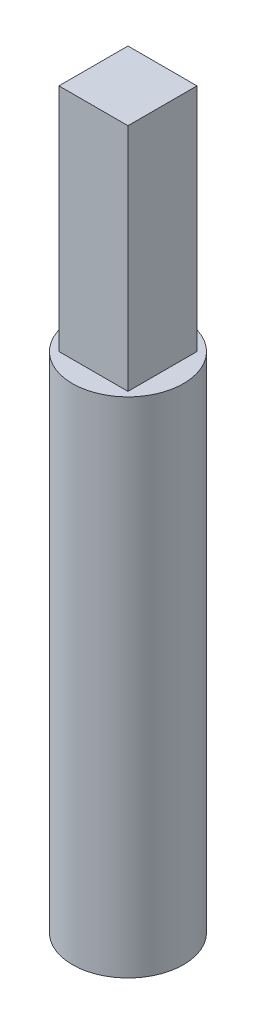
ISO-10303-21;
HEADER;
FILE_DESCRIPTION(('STEP AP214'),'2;1');
FILE_NAME('part.step','',(''),(''),'','','');
FILE_SCHEMA(('AUTOMOTIVE_DESIGN { 1 0 10303 214 1 1 1 1 }'));
ENDSEC;
DATA;
#1=APPLICATION_CONTEXT('core data for automotive mechanical design processes');
#2=APPLICATION_PROTOCOL_DEFINITION('international standard','automotive_design',2000,#1);
#3=PRODUCT_CONTEXT('',#1,'mechanical');
#4=PRODUCT('Part','Part','',(#3));
#5=PRODUCT_RELATED_PRODUCT_CATEGORY('part','',(#4));
#6=PRODUCT_DEFINITION_FORMATION('','',#4);
#7=PRODUCT_DEFINITION_CONTEXT('part definition',#1,'design');
#8=PRODUCT_DEFINITION('design','',#6,#7);
#9=PRODUCT_DEFINITION_SHAPE('','',#8);
#10=(LENGTH_UNIT() NAMED_UNIT(*) SI_UNIT(.MILLI.,.METRE.));
#11=(NAMED_UNIT(*) PLANE_ANGLE_UNIT() SI_UNIT($,.RADIAN.));
#12=(NAMED_UNIT(*) SI_UNIT($,.STERADIAN.) SOLID_ANGLE_UNIT());
#13=UNCERTAINTY_MEASURE_WITH_UNIT(LENGTH_MEASURE(1.E-05),#10,'distance_accuracy_value','');
#14=(GEOMETRIC_REPRESENTATION_CONTEXT(3) GLOBAL_UNCERTAINTY_ASSIGNED_CONTEXT((#13)) GLOBAL_UNIT_ASSIGNED_CONTEXT((#10,
#11,#12)) REPRESENTATION_CONTEXT('',''));
#15=CARTESIAN_POINT('',(0.,0.,0.));
#16=DIRECTION('',(0.,0.,1.));
#17=DIRECTION('',(1.,0.,0.));
#18=AXIS2_PLACEMENT_3D('',#15,#16,#17);
#19=CARTESIAN_POINT('',(0.,33.3375,0.));
#20=DIRECTION('',(0.,1.,0.));
#21=DIRECTION('',(0.,0.,1.));
#22=AXIS2_PLACEMENT_3D('',#19,#20,#21);
#23=PLANE('',#22);
#24=CARTESIAN_POINT('',(0.,33.3375,0.));
#25=DIRECTION('',(0.,1.,0.));
#26=DIRECTION('',(0.,0.,1.));
#27=AXIS2_PLACEMENT_3D('',#24,#25,#26);
#28=CIRCLE('',#27,3.68046);
#29=CARTESIAN_POINT('',(0.,33.3375,3.68046));
#30=VERTEX_POINT('',#29);
#31=EDGE_CURVE('E11',#30,#30,#28,.T.);
#32=ORIENTED_EDGE('',*,*,#31,.T.);
#33=EDGE_LOOP('',(#32));
#34=FACE_BOUND('',#33,.T.);
#35=DIRECTION('',(-1.,0.,0.));
#36=VECTOR('',#35,1.);
#37=CARTESIAN_POINT('',(-2.286,33.3375,-2.286));
#38=LINE('',#37,#36);
#39=CARTESIAN_POINT('',(2.286,33.3375,-2.286));
#40=VERTEX_POINT('',#39);
#41=CARTESIAN_POINT('',(-2.286,33.3375,-2.286));
#42=VERTEX_POINT('',#41);
#43=EDGE_CURVE('E89',#40,#42,#38,.T.);
#44=ORIENTED_EDGE('',*,*,#43,.F.);
#45=DIRECTION('',(0.,0.,-1.));
#46=VECTOR('',#45,1.);
#47=CARTESIAN_POINT('',(2.286,33.3375,-2.286));
#48=LINE('',#47,#46);
#49=CARTESIAN_POINT('',(2.286,33.3375,2.286));
#50=VERTEX_POINT('',#49);
#51=EDGE_CURVE('E100',#50,#40,#48,.T.);
#52=ORIENTED_EDGE('',*,*,#51,.F.);
#53=DIRECTION('',(1.,0.,0.));
#54=VECTOR('',#53,1.);
#55=CARTESIAN_POINT('',(-2.286,33.3375,2.286));
#56=LINE('',#55,#54);
#57=CARTESIAN_POINT('',(-2.286,33.3375,2.286));
#58=VERTEX_POINT('',#57);
#59=EDGE_CURVE('E70',#58,#50,#56,.T.);
#60=ORIENTED_EDGE('',*,*,#59,.F.);
#61=DIRECTION('',(0.,0.,1.));
#62=VECTOR('',#61,1.);
#63=CARTESIAN_POINT('',(-2.286,33.3375,-2.286));
#64=LINE('',#63,#62);
#65=EDGE_CURVE('E104',#42,#58,#64,.T.);
#66=ORIENTED_EDGE('',*,*,#65,.F.);
#67=EDGE_LOOP('',(#44,#52,#60,#66));
#68=FACE_BOUND('',#67,.T.);
#69=ADVANCED_FACE('F33',(#34,#68),#23,.T.);
#70=CARTESIAN_POINT('',(0.,33.3375,0.));
#71=DIRECTION('',(0.,-1.,0.));
#72=DIRECTION('',(0.,0.,-1.));
#73=AXIS2_PLACEMENT_3D('',#70,#71,#72);
#74=CYLINDRICAL_SURFACE('',#73,3.68046);
#75=ORIENTED_EDGE('',*,*,#31,.F.);
#76=EDGE_LOOP('',(#75));
#77=FACE_BOUND('',#76,.T.);
#78=CARTESIAN_POINT('',(0.,0.,0.));
#79=DIRECTION('',(0.,1.,0.));
#80=DIRECTION('',(0.,0.,1.));
#81=AXIS2_PLACEMENT_3D('',#78,#79,#80);
#82=CIRCLE('',#81,3.68046);
#83=CARTESIAN_POINT('',(0.,0.,3.68046));
#84=VERTEX_POINT('',#83);
#85=EDGE_CURVE('E37',#84,#84,#82,.T.);
#86=ORIENTED_EDGE('',*,*,#85,.T.);
#87=EDGE_LOOP('',(#86));
#88=FACE_BOUND('',#87,.T.);
#89=ADVANCED_FACE('F35',(#77,#88),#74,.T.);
#90=CARTESIAN_POINT('',(0.,0.,0.));
#91=DIRECTION('',(0.,1.,0.));
#92=DIRECTION('',(0.,0.,1.));
#93=AXIS2_PLACEMENT_3D('',#90,#91,#92);
#94=PLANE('',#93);
#95=ORIENTED_EDGE('',*,*,#85,.F.);
#96=EDGE_LOOP('',(#95));
#97=FACE_BOUND('',#96,.T.);
#98=ADVANCED_FACE('F113',(#97),#94,.F.);
#99=CARTESIAN_POINT('',(2.286,48.5775,-2.286));
#100=DIRECTION('',(-1.,0.,0.));
#101=DIRECTION('',(0.,0.,1.));
#102=AXIS2_PLACEMENT_3D('',#99,#100,#101);
#103=PLANE('',#102);
#104=ORIENTED_EDGE('',*,*,#51,.T.);
#105=DIRECTION('',(0.,-1.,0.));
#106=VECTOR('',#105,1.);
#107=CARTESIAN_POINT('',(2.286,48.5775,-2.286));
#108=LINE('',#107,#106);
#109=CARTESIAN_POINT('',(2.286,48.5775,-2.286));
#110=VERTEX_POINT('',#109);
#111=EDGE_CURVE('E92',#110,#40,#108,.T.);
#112=ORIENTED_EDGE('',*,*,#111,.F.);
#113=DIRECTION('',(0.,0.,-1.));
#114=VECTOR('',#113,1.);
#115=CARTESIAN_POINT('',(2.286,48.5775,-2.286));
#116=LINE('',#115,#114);
#117=CARTESIAN_POINT('',(2.286,48.5775,2.286));
#118=VERTEX_POINT('',#117);
#119=EDGE_CURVE('E82',#118,#110,#116,.T.);
#120=ORIENTED_EDGE('',*,*,#119,.F.);
#121=DIRECTION('',(0.,-1.,0.));
#122=VECTOR('',#121,1.);
#123=CARTESIAN_POINT('',(2.286,48.5775,2.286));
#124=LINE('',#123,#122);
#125=EDGE_CURVE('E96',#118,#50,#124,.T.);
#126=ORIENTED_EDGE('',*,*,#125,.T.);
#127=EDGE_LOOP('',(#104,#112,#120,#126));
#128=FACE_BOUND('',#127,.T.);
#129=ADVANCED_FACE('F115',(#128),#103,.F.);
#130=CARTESIAN_POINT('',(-2.286,48.5775,-2.286));
#131=DIRECTION('',(0.,0.,1.));
#132=DIRECTION('',(1.,0.,0.));
#133=AXIS2_PLACEMENT_3D('',#130,#131,#132);
#134=PLANE('',#133);
#135=ORIENTED_EDGE('',*,*,#43,.T.);
#136=DIRECTION('',(0.,-1.,0.));
#137=VECTOR('',#136,1.);
#138=CARTESIAN_POINT('',(-2.286,48.5775,-2.286));
#139=LINE('',#138,#137);
#140=CARTESIAN_POINT('',(-2.286,48.5775,-2.286));
#141=VERTEX_POINT('',#140);
#142=EDGE_CURVE('E86',#141,#42,#139,.T.);
#143=ORIENTED_EDGE('',*,*,#142,.F.);
#144=DIRECTION('',(-1.,0.,0.));
#145=VECTOR('',#144,1.);
#146=CARTESIAN_POINT('',(-2.286,48.5775,-2.286));
#147=LINE('',#146,#145);
#148=EDGE_CURVE('E77',#110,#141,#147,.T.);
#149=ORIENTED_EDGE('',*,*,#148,.F.);
#150=ORIENTED_EDGE('',*,*,#111,.T.);
#151=EDGE_LOOP('',(#135,#143,#149,#150));
#152=FACE_BOUND('',#151,.T.);
#153=ADVANCED_FACE('F87',(#152),#134,.F.);
#154=CARTESIAN_POINT('',(-2.286,48.5775,-2.286));
#155=DIRECTION('',(1.,0.,0.));
#156=DIRECTION('',(0.,0.,-1.));
#157=AXIS2_PLACEMENT_3D('',#154,#155,#156);
#158=PLANE('',#157);
#159=ORIENTED_EDGE('',*,*,#65,.T.);
#160=DIRECTION('',(0.,-1.,0.));
#161=VECTOR('',#160,1.);
#162=CARTESIAN_POINT('',(-2.286,48.5775,2.286));
#163=LINE('',#162,#161);
#164=CARTESIAN_POINT('',(-2.286,48.5775,2.286));
#165=VERTEX_POINT('',#164);
#166=EDGE_CURVE('E48',#165,#58,#163,.T.);
#167=ORIENTED_EDGE('',*,*,#166,.F.);
#168=DIRECTION('',(0.,0.,1.));
#169=VECTOR('',#168,1.);
#170=CARTESIAN_POINT('',(-2.286,48.5775,-2.286));
#171=LINE('',#170,#169);
#172=EDGE_CURVE('E80',#141,#165,#171,.T.);
#173=ORIENTED_EDGE('',*,*,#172,.F.);
#174=ORIENTED_EDGE('',*,*,#142,.T.);
#175=EDGE_LOOP('',(#159,#167,#173,#174));
#176=FACE_BOUND('',#175,.T.);
#177=ADVANCED_FACE('F94',(#176),#158,.F.);
#178=CARTESIAN_POINT('',(-2.286,48.5775,2.286));
#179=DIRECTION('',(0.,0.,-1.));
#180=DIRECTION('',(-1.,0.,0.));
#181=AXIS2_PLACEMENT_3D('',#178,#179,#180);
#182=PLANE('',#181);
#183=ORIENTED_EDGE('',*,*,#59,.T.);
#184=ORIENTED_EDGE('',*,*,#125,.F.);
#185=DIRECTION('',(1.,0.,0.));
#186=VECTOR('',#185,1.);
#187=CARTESIAN_POINT('',(-2.286,48.5775,2.286));
#188=LINE('',#187,#186);
#189=EDGE_CURVE('E56',#165,#118,#188,.T.);
#190=ORIENTED_EDGE('',*,*,#189,.F.);
#191=ORIENTED_EDGE('',*,*,#166,.T.);
#192=EDGE_LOOP('',(#183,#184,#190,#191));
#193=FACE_BOUND('',#192,.T.);
#194=ADVANCED_FACE('F134',(#193),#182,.F.);
#195=CARTESIAN_POINT('',(0.,48.5775,0.));
#196=DIRECTION('',(0.,1.,0.));
#197=DIRECTION('',(0.,0.,1.));
#198=AXIS2_PLACEMENT_3D('',#195,#196,#197);
#199=PLANE('',#198);
#200=ORIENTED_EDGE('',*,*,#119,.T.);
#201=ORIENTED_EDGE('',*,*,#148,.T.);
#202=ORIENTED_EDGE('',*,*,#172,.T.);
#203=ORIENTED_EDGE('',*,*,#189,.T.);
#204=EDGE_LOOP('',(#200,#201,#202,#203));
#205=FACE_BOUND('',#204,.T.);
#206=ADVANCED_FACE('F78',(#205),#199,.T.);
#207=CLOSED_SHELL('',(#69,#89,#98,#129,#153,#177,#194,#206));
#208=MANIFOLD_SOLID_BREP('B2',#207);
#209=ADVANCED_BREP_SHAPE_REPRESENTATION('',(#18,#208),#14);
#210=SHAPE_DEFINITION_REPRESENTATION(#9,#209);
ENDSEC;
END-ISO-10303-21;
